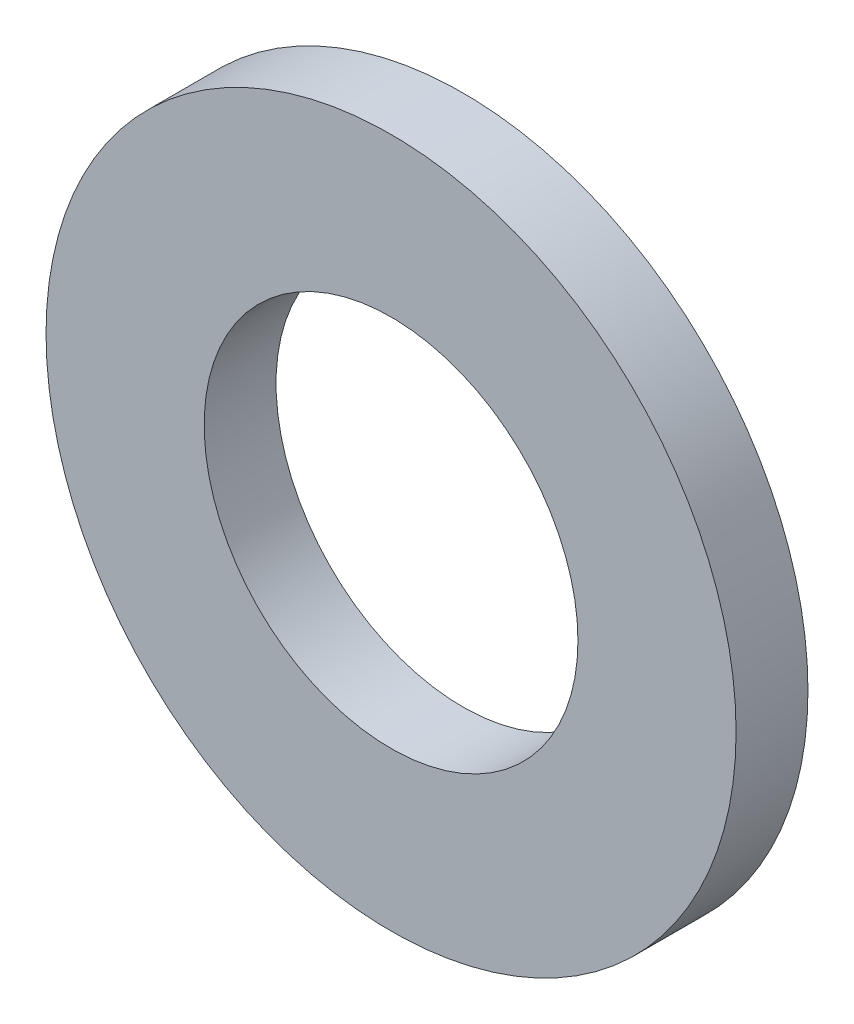
ISO-10303-21;
HEADER;
FILE_DESCRIPTION(('STEP AP214'),'2;1');
FILE_NAME('part.step','',(''),(''),'','','');
FILE_SCHEMA(('AUTOMOTIVE_DESIGN { 1 0 10303 214 1 1 1 1 }'));
ENDSEC;
DATA;
#1=APPLICATION_CONTEXT('core data for automotive mechanical design processes');
#2=APPLICATION_PROTOCOL_DEFINITION('international standard','automotive_design',2000,#1);
#3=PRODUCT_CONTEXT('',#1,'mechanical');
#4=PRODUCT('Part','Part','',(#3));
#5=PRODUCT_RELATED_PRODUCT_CATEGORY('part','',(#4));
#6=PRODUCT_DEFINITION_FORMATION('','',#4);
#7=PRODUCT_DEFINITION_CONTEXT('part definition',#1,'design');
#8=PRODUCT_DEFINITION('design','',#6,#7);
#9=PRODUCT_DEFINITION_SHAPE('','',#8);
#10=(LENGTH_UNIT() NAMED_UNIT(*) SI_UNIT(.MILLI.,.METRE.));
#11=(NAMED_UNIT(*) PLANE_ANGLE_UNIT() SI_UNIT($,.RADIAN.));
#12=(NAMED_UNIT(*) SI_UNIT($,.STERADIAN.) SOLID_ANGLE_UNIT());
#13=UNCERTAINTY_MEASURE_WITH_UNIT(LENGTH_MEASURE(1.E-05),#10,'distance_accuracy_value','');
#14=(GEOMETRIC_REPRESENTATION_CONTEXT(3) GLOBAL_UNCERTAINTY_ASSIGNED_CONTEXT((#13)) GLOBAL_UNIT_ASSIGNED_CONTEXT((#10,
#11,#12)) REPRESENTATION_CONTEXT('',''));
#15=CARTESIAN_POINT('',(0.,0.,0.));
#16=DIRECTION('',(0.,0.,1.));
#17=DIRECTION('',(1.,0.,0.));
#18=AXIS2_PLACEMENT_3D('',#15,#16,#17);
#19=CARTESIAN_POINT('',(0.,0.,2.5));
#20=DIRECTION('',(0.,0.,1.));
#21=DIRECTION('',(1.,0.,0.));
#22=AXIS2_PLACEMENT_3D('',#19,#20,#21);
#23=PLANE('',#22);
#24=CARTESIAN_POINT('',(0.,0.,2.5));
#25=DIRECTION('',(0.,0.,1.));
#26=DIRECTION('',(1.,0.,0.));
#27=AXIS2_PLACEMENT_3D('',#24,#25,#26);
#28=CIRCLE('',#27,12.);
#29=CARTESIAN_POINT('',(12.,0.,2.5));
#30=VERTEX_POINT('',#29);
#31=EDGE_CURVE('E10',#30,#30,#28,.T.);
#32=ORIENTED_EDGE('',*,*,#31,.T.);
#33=EDGE_LOOP('',(#32));
#34=FACE_BOUND('',#33,.T.);
#35=CARTESIAN_POINT('',(0.,0.,2.5));
#36=DIRECTION('',(0.,0.,1.));
#37=DIRECTION('',(1.,0.,0.));
#38=AXIS2_PLACEMENT_3D('',#35,#36,#37);
#39=CIRCLE('',#38,6.5);
#40=CARTESIAN_POINT('',(6.5,0.,2.5));
#41=VERTEX_POINT('',#40);
#42=EDGE_CURVE('E41',#41,#41,#39,.T.);
#43=ORIENTED_EDGE('',*,*,#42,.F.);
#44=EDGE_LOOP('',(#43));
#45=FACE_BOUND('',#44,.T.);
#46=ADVANCED_FACE('F30',(#34,#45),#23,.T.);
#47=CARTESIAN_POINT('',(0.,0.,0.));
#48=DIRECTION('',(0.,0.,1.));
#49=DIRECTION('',(1.,0.,0.));
#50=AXIS2_PLACEMENT_3D('',#47,#48,#49);
#51=PLANE('',#50);
#52=CARTESIAN_POINT('',(0.,0.,0.));
#53=DIRECTION('',(0.,0.,1.));
#54=DIRECTION('',(1.,0.,0.));
#55=AXIS2_PLACEMENT_3D('',#52,#53,#54);
#56=CIRCLE('',#55,12.);
#57=CARTESIAN_POINT('',(12.,0.,0.));
#58=VERTEX_POINT('',#57);
#59=EDGE_CURVE('E34',#58,#58,#56,.T.);
#60=ORIENTED_EDGE('',*,*,#59,.F.);
#61=EDGE_LOOP('',(#60));
#62=FACE_BOUND('',#61,.T.);
#63=CARTESIAN_POINT('',(0.,0.,0.));
#64=DIRECTION('',(0.,0.,1.));
#65=DIRECTION('',(1.,0.,0.));
#66=AXIS2_PLACEMENT_3D('',#63,#64,#65);
#67=CIRCLE('',#66,6.5);
#68=CARTESIAN_POINT('',(6.5,0.,0.));
#69=VERTEX_POINT('',#68);
#70=EDGE_CURVE('E43',#69,#69,#67,.T.);
#71=ORIENTED_EDGE('',*,*,#70,.T.);
#72=EDGE_LOOP('',(#71));
#73=FACE_BOUND('',#72,.T.);
#74=ADVANCED_FACE('F53',(#62,#73),#51,.F.);
#75=CARTESIAN_POINT('',(0.,0.,2.5));
#76=DIRECTION('',(0.,0.,-1.));
#77=DIRECTION('',(-1.,0.,0.));
#78=AXIS2_PLACEMENT_3D('',#75,#76,#77);
#79=CYLINDRICAL_SURFACE('',#78,12.);
#80=ORIENTED_EDGE('',*,*,#31,.F.);
#81=EDGE_LOOP('',(#80));
#82=FACE_BOUND('',#81,.T.);
#83=ORIENTED_EDGE('',*,*,#59,.T.);
#84=EDGE_LOOP('',(#83));
#85=FACE_BOUND('',#84,.T.);
#86=ADVANCED_FACE('F32',(#82,#85),#79,.T.);
#87=CARTESIAN_POINT('',(0.,0.,2.5));
#88=DIRECTION('',(0.,0.,-1.));
#89=DIRECTION('',(-1.,0.,0.));
#90=AXIS2_PLACEMENT_3D('',#87,#88,#89);
#91=CYLINDRICAL_SURFACE('',#90,6.5);
#92=ORIENTED_EDGE('',*,*,#42,.T.);
#93=EDGE_LOOP('',(#92));
#94=FACE_BOUND('',#93,.T.);
#95=ORIENTED_EDGE('',*,*,#70,.F.);
#96=EDGE_LOOP('',(#95));
#97=FACE_BOUND('',#96,.T.);
#98=ADVANCED_FACE('F49',(#94,#97),#91,.F.);
#99=CLOSED_SHELL('',(#46,#74,#86,#98));
#100=MANIFOLD_SOLID_BREP('B2',#99);
#101=ADVANCED_BREP_SHAPE_REPRESENTATION('',(#18,#100),#14);
#102=SHAPE_DEFINITION_REPRESENTATION(#9,#101);
ENDSEC;
END-ISO-10303-21;
